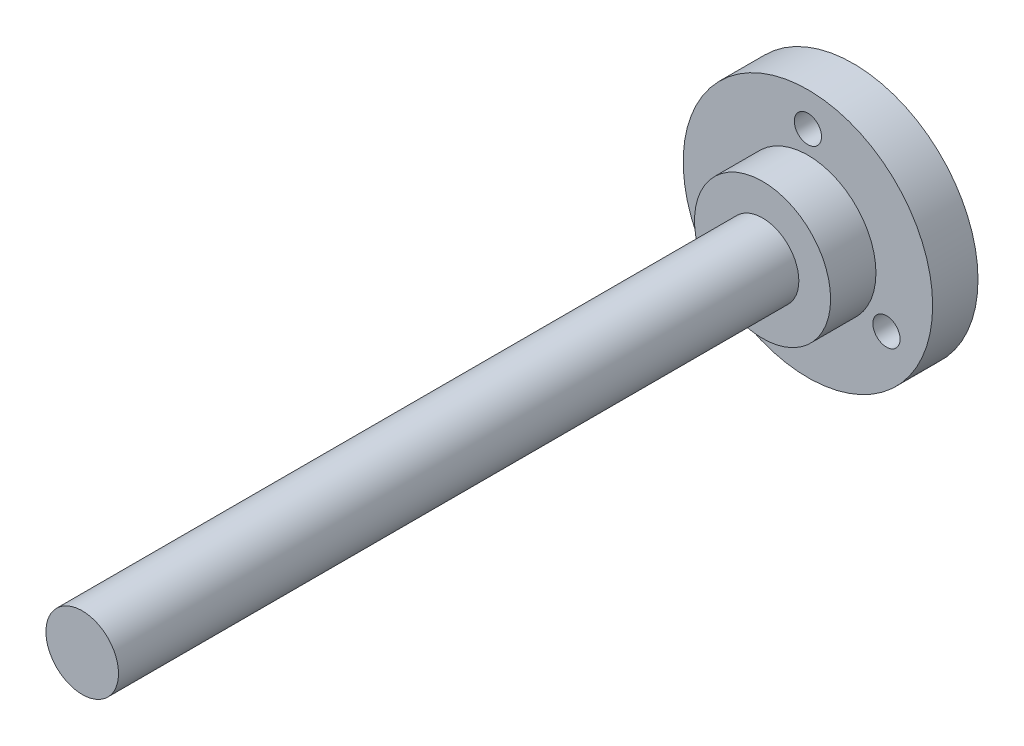
ISO-10303-21;
HEADER;
FILE_DESCRIPTION(('STEP AP214'),'2;1');
FILE_NAME('part.step','',(''),(''),'','','');
FILE_SCHEMA(('AUTOMOTIVE_DESIGN { 1 0 10303 214 1 1 1 1 }'));
ENDSEC;
DATA;
#1=APPLICATION_CONTEXT('core data for automotive mechanical design processes');
#2=APPLICATION_PROTOCOL_DEFINITION('international standard','automotive_design',2000,#1);
#3=PRODUCT_CONTEXT('',#1,'mechanical');
#4=PRODUCT('Part','Part','',(#3));
#5=PRODUCT_RELATED_PRODUCT_CATEGORY('part','',(#4));
#6=PRODUCT_DEFINITION_FORMATION('','',#4);
#7=PRODUCT_DEFINITION_CONTEXT('part definition',#1,'design');
#8=PRODUCT_DEFINITION('design','',#6,#7);
#9=PRODUCT_DEFINITION_SHAPE('','',#8);
#10=(LENGTH_UNIT() NAMED_UNIT(*) SI_UNIT(.MILLI.,.METRE.));
#11=(NAMED_UNIT(*) PLANE_ANGLE_UNIT() SI_UNIT($,.RADIAN.));
#12=(NAMED_UNIT(*) SI_UNIT($,.STERADIAN.) SOLID_ANGLE_UNIT());
#13=UNCERTAINTY_MEASURE_WITH_UNIT(LENGTH_MEASURE(1.E-05),#10,'distance_accuracy_value','');
#14=(GEOMETRIC_REPRESENTATION_CONTEXT(3) GLOBAL_UNCERTAINTY_ASSIGNED_CONTEXT((#13)) GLOBAL_UNIT_ASSIGNED_CONTEXT((#10,
#11,#12)) REPRESENTATION_CONTEXT('',''));
#15=CARTESIAN_POINT('',(0.,0.,0.));
#16=DIRECTION('',(0.,0.,1.));
#17=DIRECTION('',(1.,0.,0.));
#18=AXIS2_PLACEMENT_3D('',#15,#16,#17);
#19=CARTESIAN_POINT('',(0.,0.,20.));
#20=DIRECTION('',(0.,0.,1.));
#21=DIRECTION('',(1.,0.,0.));
#22=AXIS2_PLACEMENT_3D('',#19,#20,#21);
#23=PLANE('',#22);
#24=CARTESIAN_POINT('',(0.,0.,20.));
#25=DIRECTION('',(0.,0.,1.));
#26=DIRECTION('',(1.,0.,0.));
#27=AXIS2_PLACEMENT_3D('',#24,#25,#26);
#28=CIRCLE('',#27,15.);
#29=CARTESIAN_POINT('',(15.,0.,20.));
#30=VERTEX_POINT('',#29);
#31=EDGE_CURVE('E57',#30,#30,#28,.T.);
#32=ORIENTED_EDGE('',*,*,#31,.T.);
#33=EDGE_LOOP('',(#32));
#34=FACE_BOUND('',#33,.T.);
#35=CARTESIAN_POINT('',(0.,0.,20.));
#36=DIRECTION('',(0.,0.,1.));
#37=DIRECTION('',(1.,0.,0.));
#38=AXIS2_PLACEMENT_3D('',#35,#36,#37);
#39=CIRCLE('',#38,8.);
#40=CARTESIAN_POINT('',(8.,0.,20.));
#41=VERTEX_POINT('',#40);
#42=EDGE_CURVE('E66',#41,#41,#39,.T.);
#43=ORIENTED_EDGE('',*,*,#42,.F.);
#44=EDGE_LOOP('',(#43));
#45=FACE_BOUND('',#44,.T.);
#46=ADVANCED_FACE('F29',(#34,#45),#23,.T.);
#47=CARTESIAN_POINT('',(0.,0.,10.));
#48=DIRECTION('',(0.,0.,1.));
#49=DIRECTION('',(1.,0.,0.));
#50=AXIS2_PLACEMENT_3D('',#47,#48,#49);
#51=PLANE('',#50);
#52=CARTESIAN_POINT('',(-17.3205080756888,-10.,10.));
#53=DIRECTION('',(0.,0.,1.));
#54=DIRECTION('',(1.,0.,0.));
#55=AXIS2_PLACEMENT_3D('',#52,#53,#54);
#56=CIRCLE('',#55,3.);
#57=CARTESIAN_POINT('',(-14.3205080756888,-10.,10.));
#58=VERTEX_POINT('',#57);
#59=EDGE_CURVE('E51',#58,#58,#56,.T.);
#60=ORIENTED_EDGE('',*,*,#59,.F.);
#61=EDGE_LOOP('',(#60));
#62=FACE_BOUND('',#61,.T.);
#63=CARTESIAN_POINT('',(0.,20.,10.));
#64=DIRECTION('',(0.,0.,1.));
#65=DIRECTION('',(1.,0.,0.));
#66=AXIS2_PLACEMENT_3D('',#63,#64,#65);
#67=CIRCLE('',#66,3.);
#68=CARTESIAN_POINT('',(3.,20.,10.));
#69=VERTEX_POINT('',#68);
#70=EDGE_CURVE('E40',#69,#69,#67,.T.);
#71=ORIENTED_EDGE('',*,*,#70,.F.);
#72=EDGE_LOOP('',(#71));
#73=FACE_BOUND('',#72,.T.);
#74=CARTESIAN_POINT('',(0.,0.,10.));
#75=DIRECTION('',(0.,0.,1.));
#76=DIRECTION('',(1.,0.,0.));
#77=AXIS2_PLACEMENT_3D('',#74,#75,#76);
#78=CIRCLE('',#77,27.5);
#79=CARTESIAN_POINT('',(27.5,0.,10.));
#80=VERTEX_POINT('',#79);
#81=EDGE_CURVE('E10',#80,#80,#78,.T.);
#82=ORIENTED_EDGE('',*,*,#81,.T.);
#83=EDGE_LOOP('',(#82));
#84=FACE_BOUND('',#83,.T.);
#85=CARTESIAN_POINT('',(17.3205080756888,-10.,10.));
#86=DIRECTION('',(0.,0.,1.));
#87=DIRECTION('',(1.,0.,0.));
#88=AXIS2_PLACEMENT_3D('',#85,#86,#87);
#89=CIRCLE('',#88,3.);
#90=CARTESIAN_POINT('',(20.3205080756888,-10.,10.));
#91=VERTEX_POINT('',#90);
#92=EDGE_CURVE('E45',#91,#91,#89,.T.);
#93=ORIENTED_EDGE('',*,*,#92,.F.);
#94=EDGE_LOOP('',(#93));
#95=FACE_BOUND('',#94,.T.);
#96=CARTESIAN_POINT('',(0.,0.,10.));
#97=DIRECTION('',(0.,0.,1.));
#98=DIRECTION('',(1.,0.,0.));
#99=AXIS2_PLACEMENT_3D('',#96,#97,#98);
#100=CIRCLE('',#99,15.);
#101=CARTESIAN_POINT('',(15.,0.,10.));
#102=VERTEX_POINT('',#101);
#103=EDGE_CURVE('E60',#102,#102,#100,.T.);
#104=ORIENTED_EDGE('',*,*,#103,.F.);
#105=EDGE_LOOP('',(#104));
#106=FACE_BOUND('',#105,.T.);
#107=ADVANCED_FACE('F82',(#62,#73,#84,#95,#106),#51,.T.);
#108=CARTESIAN_POINT('',(0.,0.,0.));
#109=DIRECTION('',(0.,0.,1.));
#110=DIRECTION('',(1.,0.,0.));
#111=AXIS2_PLACEMENT_3D('',#108,#109,#110);
#112=PLANE('',#111);
#113=CARTESIAN_POINT('',(17.3205080756888,-10.,0.));
#114=DIRECTION('',(0.,0.,1.));
#115=DIRECTION('',(1.,0.,0.));
#116=AXIS2_PLACEMENT_3D('',#113,#114,#115);
#117=CIRCLE('',#116,3.);
#118=CARTESIAN_POINT('',(20.3205080756888,-10.,0.));
#119=VERTEX_POINT('',#118);
#120=EDGE_CURVE('E48',#119,#119,#117,.T.);
#121=ORIENTED_EDGE('',*,*,#120,.T.);
#122=EDGE_LOOP('',(#121));
#123=FACE_BOUND('',#122,.T.);
#124=CARTESIAN_POINT('',(0.,0.,0.));
#125=DIRECTION('',(0.,0.,1.));
#126=DIRECTION('',(1.,0.,0.));
#127=AXIS2_PLACEMENT_3D('',#124,#125,#126);
#128=CIRCLE('',#127,27.5);
#129=CARTESIAN_POINT('',(27.5,0.,0.));
#130=VERTEX_POINT('',#129);
#131=EDGE_CURVE('E33',#130,#130,#128,.T.);
#132=ORIENTED_EDGE('',*,*,#131,.F.);
#133=EDGE_LOOP('',(#132));
#134=FACE_BOUND('',#133,.T.);
#135=CARTESIAN_POINT('',(0.,20.,0.));
#136=DIRECTION('',(0.,0.,1.));
#137=DIRECTION('',(1.,0.,0.));
#138=AXIS2_PLACEMENT_3D('',#135,#136,#137);
#139=CIRCLE('',#138,3.);
#140=CARTESIAN_POINT('',(3.,20.,0.));
#141=VERTEX_POINT('',#140);
#142=EDGE_CURVE('E42',#141,#141,#139,.T.);
#143=ORIENTED_EDGE('',*,*,#142,.T.);
#144=EDGE_LOOP('',(#143));
#145=FACE_BOUND('',#144,.T.);
#146=CARTESIAN_POINT('',(-17.3205080756888,-10.,0.));
#147=DIRECTION('',(0.,0.,1.));
#148=DIRECTION('',(1.,0.,0.));
#149=AXIS2_PLACEMENT_3D('',#146,#147,#148);
#150=CIRCLE('',#149,3.);
#151=CARTESIAN_POINT('',(-14.3205080756888,-10.,0.));
#152=VERTEX_POINT('',#151);
#153=EDGE_CURVE('E54',#152,#152,#150,.T.);
#154=ORIENTED_EDGE('',*,*,#153,.T.);
#155=EDGE_LOOP('',(#154));
#156=FACE_BOUND('',#155,.T.);
#157=ADVANCED_FACE('F88',(#123,#134,#145,#156),#112,.F.);
#158=CARTESIAN_POINT('',(0.,0.,10.));
#159=DIRECTION('',(0.,0.,-1.));
#160=DIRECTION('',(-1.,0.,0.));
#161=AXIS2_PLACEMENT_3D('',#158,#159,#160);
#162=CYLINDRICAL_SURFACE('',#161,27.5);
#163=ORIENTED_EDGE('',*,*,#81,.F.);
#164=EDGE_LOOP('',(#163));
#165=FACE_BOUND('',#164,.T.);
#166=ORIENTED_EDGE('',*,*,#131,.T.);
#167=EDGE_LOOP('',(#166));
#168=FACE_BOUND('',#167,.T.);
#169=ADVANCED_FACE('F31',(#165,#168),#162,.T.);
#170=CARTESIAN_POINT('',(0.,20.,10.));
#171=DIRECTION('',(0.,0.,-1.));
#172=DIRECTION('',(-1.,0.,0.));
#173=AXIS2_PLACEMENT_3D('',#170,#171,#172);
#174=CYLINDRICAL_SURFACE('',#173,3.);
#175=ORIENTED_EDGE('',*,*,#70,.T.);
#176=EDGE_LOOP('',(#175));
#177=FACE_BOUND('',#176,.T.);
#178=ORIENTED_EDGE('',*,*,#142,.F.);
#179=EDGE_LOOP('',(#178));
#180=FACE_BOUND('',#179,.T.);
#181=ADVANCED_FACE('F103',(#177,#180),#174,.F.);
#182=CARTESIAN_POINT('',(17.3205080756888,-10.,10.));
#183=DIRECTION('',(0.,0.,-1.));
#184=DIRECTION('',(-1.,0.,0.));
#185=AXIS2_PLACEMENT_3D('',#182,#183,#184);
#186=CYLINDRICAL_SURFACE('',#185,3.);
#187=ORIENTED_EDGE('',*,*,#92,.T.);
#188=EDGE_LOOP('',(#187));
#189=FACE_BOUND('',#188,.T.);
#190=ORIENTED_EDGE('',*,*,#120,.F.);
#191=EDGE_LOOP('',(#190));
#192=FACE_BOUND('',#191,.T.);
#193=ADVANCED_FACE('F99',(#189,#192),#186,.F.);
#194=CARTESIAN_POINT('',(-17.3205080756888,-10.,10.));
#195=DIRECTION('',(0.,0.,-1.));
#196=DIRECTION('',(-1.,0.,0.));
#197=AXIS2_PLACEMENT_3D('',#194,#195,#196);
#198=CYLINDRICAL_SURFACE('',#197,3.);
#199=ORIENTED_EDGE('',*,*,#59,.T.);
#200=EDGE_LOOP('',(#199));
#201=FACE_BOUND('',#200,.T.);
#202=ORIENTED_EDGE('',*,*,#153,.F.);
#203=EDGE_LOOP('',(#202));
#204=FACE_BOUND('',#203,.T.);
#205=ADVANCED_FACE('F95',(#201,#204),#198,.F.);
#206=CARTESIAN_POINT('',(0.,0.,20.));
#207=DIRECTION('',(0.,0.,-1.));
#208=DIRECTION('',(-1.,0.,0.));
#209=AXIS2_PLACEMENT_3D('',#206,#207,#208);
#210=CYLINDRICAL_SURFACE('',#209,15.);
#211=ORIENTED_EDGE('',*,*,#31,.F.);
#212=EDGE_LOOP('',(#211));
#213=FACE_BOUND('',#212,.T.);
#214=ORIENTED_EDGE('',*,*,#103,.T.);
#215=EDGE_LOOP('',(#214));
#216=FACE_BOUND('',#215,.T.);
#217=ADVANCED_FACE('F77',(#213,#216),#210,.T.);
#218=CARTESIAN_POINT('',(0.,0.,170.));
#219=DIRECTION('',(0.,0.,-1.));
#220=DIRECTION('',(-1.,0.,0.));
#221=AXIS2_PLACEMENT_3D('',#218,#219,#220);
#222=CYLINDRICAL_SURFACE('',#221,8.);
#223=CARTESIAN_POINT('',(0.,0.,170.));
#224=DIRECTION('',(0.,0.,1.));
#225=DIRECTION('',(1.,0.,0.));
#226=AXIS2_PLACEMENT_3D('',#223,#224,#225);
#227=CIRCLE('',#226,8.);
#228=CARTESIAN_POINT('',(8.,0.,170.));
#229=VERTEX_POINT('',#228);
#230=EDGE_CURVE('E63',#229,#229,#227,.T.);
#231=ORIENTED_EDGE('',*,*,#230,.F.);
#232=EDGE_LOOP('',(#231));
#233=FACE_BOUND('',#232,.T.);
#234=ORIENTED_EDGE('',*,*,#42,.T.);
#235=EDGE_LOOP('',(#234));
#236=FACE_BOUND('',#235,.T.);
#237=ADVANCED_FACE('F74',(#233,#236),#222,.T.);
#238=CARTESIAN_POINT('',(0.,0.,170.));
#239=DIRECTION('',(0.,0.,1.));
#240=DIRECTION('',(1.,0.,0.));
#241=AXIS2_PLACEMENT_3D('',#238,#239,#240);
#242=PLANE('',#241);
#243=ORIENTED_EDGE('',*,*,#230,.T.);
#244=EDGE_LOOP('',(#243));
#245=FACE_BOUND('',#244,.T.);
#246=ADVANCED_FACE('F72',(#245),#242,.T.);
#247=CLOSED_SHELL('',(#46,#107,#157,#169,#181,#193,#205,#217,#237,#246));
#248=MANIFOLD_SOLID_BREP('B2',#247);
#249=ADVANCED_BREP_SHAPE_REPRESENTATION('',(#18,#248),#14);
#250=SHAPE_DEFINITION_REPRESENTATION(#9,#249);
ENDSEC;
END-ISO-10303-21;
